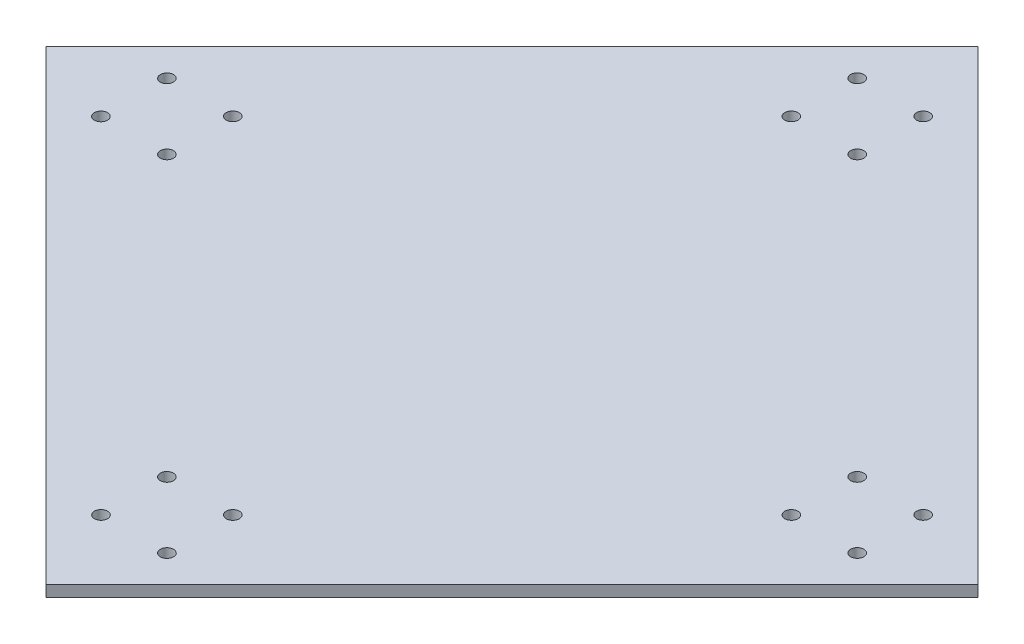
ISO-10303-21;
HEADER;
FILE_DESCRIPTION(('STEP AP214'),'2;1');
FILE_NAME('part.step','',(''),(''),'','','');
FILE_SCHEMA(('AUTOMOTIVE_DESIGN { 1 0 10303 214 1 1 1 1 }'));
ENDSEC;
DATA;
#1=APPLICATION_CONTEXT('core data for automotive mechanical design processes');
#2=APPLICATION_PROTOCOL_DEFINITION('international standard','automotive_design',2000,#1);
#3=PRODUCT_CONTEXT('',#1,'mechanical');
#4=PRODUCT('Part','Part','',(#3));
#5=PRODUCT_RELATED_PRODUCT_CATEGORY('part','',(#4));
#6=PRODUCT_DEFINITION_FORMATION('','',#4);
#7=PRODUCT_DEFINITION_CONTEXT('part definition',#1,'design');
#8=PRODUCT_DEFINITION('design','',#6,#7);
#9=PRODUCT_DEFINITION_SHAPE('','',#8);
#10=(LENGTH_UNIT() NAMED_UNIT(*) SI_UNIT(.MILLI.,.METRE.));
#11=(NAMED_UNIT(*) PLANE_ANGLE_UNIT() SI_UNIT($,.RADIAN.));
#12=(NAMED_UNIT(*) SI_UNIT($,.STERADIAN.) SOLID_ANGLE_UNIT());
#13=UNCERTAINTY_MEASURE_WITH_UNIT(LENGTH_MEASURE(1.E-05),#10,'distance_accuracy_value','');
#14=(GEOMETRIC_REPRESENTATION_CONTEXT(3) GLOBAL_UNCERTAINTY_ASSIGNED_CONTEXT((#13)) GLOBAL_UNIT_ASSIGNED_CONTEXT((#10,
#11,#12)) REPRESENTATION_CONTEXT('',''));
#15=CARTESIAN_POINT('',(0.,0.,0.));
#16=DIRECTION('',(0.,0.,1.));
#17=DIRECTION('',(1.,0.,0.));
#18=AXIS2_PLACEMENT_3D('',#15,#16,#17);
#19=CARTESIAN_POINT('',(141283.553059049,2500.,-141283.553059049));
#20=DIRECTION('',(0.707106781186548,0.,-0.707106781186548));
#21=DIRECTION('',(-0.707106781186548,0.,-0.707106781186548));
#22=AXIS2_PLACEMENT_3D('',#19,#20,#21);
#23=PLANE('',#22);
#24=DIRECTION('',(0.707106781186548,0.,0.707106781186548));
#25=VECTOR('',#24,1.);
#26=CARTESIAN_POINT('',(141283.553059049,0.,-141283.553059049));
#27=LINE('',#26,#25);
#28=CARTESIAN_POINT('',(94457.3926097364,0.,-188109.713508362));
#29=VERTEX_POINT('',#28);
#30=CARTESIAN_POINT('',(200523.409787719,0.,-82043.6963303794));
#31=VERTEX_POINT('',#30);
#32=EDGE_CURVE('E179',#29,#31,#27,.T.);
#33=ORIENTED_EDGE('',*,*,#32,.F.);
#34=DIRECTION('',(0.,-1.,0.));
#35=VECTOR('',#34,1.);
#36=CARTESIAN_POINT('',(94457.3926097364,2500.,-188109.713508362));
#37=LINE('',#36,#35);
#38=CARTESIAN_POINT('',(94457.3926097364,2500.,-188109.713508362));
#39=VERTEX_POINT('',#38);
#40=EDGE_CURVE('E11',#39,#29,#37,.T.);
#41=ORIENTED_EDGE('',*,*,#40,.F.);
#42=DIRECTION('',(0.707106781186548,0.,0.707106781186548));
#43=VECTOR('',#42,1.);
#44=CARTESIAN_POINT('',(141283.553059049,2500.,-141283.553059049));
#45=LINE('',#44,#43);
#46=CARTESIAN_POINT('',(200523.409787719,2500.,-82043.6963303794));
#47=VERTEX_POINT('',#46);
#48=EDGE_CURVE('E105',#39,#47,#45,.T.);
#49=ORIENTED_EDGE('',*,*,#48,.T.);
#50=DIRECTION('',(0.,-1.,0.));
#51=VECTOR('',#50,1.);
#52=CARTESIAN_POINT('',(200523.409787719,2500.,-82043.6963303794));
#53=LINE('',#52,#51);
#54=EDGE_CURVE('E82',#47,#31,#53,.T.);
#55=ORIENTED_EDGE('',*,*,#54,.T.);
#56=EDGE_LOOP('',(#33,#41,#49,#55));
#57=FACE_BOUND('',#56,.T.);
#58=ADVANCED_FACE('F41',(#57),#23,.T.);
#59=CARTESIAN_POINT('',(-46826.1595327832,2500.,-46826.1586240655));
#60=DIRECTION('',(-0.707106788047674,0.,-0.707106774325421));
#61=DIRECTION('',(-0.707106774325421,0.,0.707106788047674));
#62=AXIS2_PLACEMENT_3D('',#59,#60,#61);
#63=PLANE('',#62);
#64=DIRECTION('',(0.707106774325421,0.,-0.707106788047674));
#65=VECTOR('',#64,1.);
#66=CARTESIAN_POINT('',(-46826.1595327832,0.,-46826.1586240655));
#67=LINE('',#66,#65);
#68=CARTESIAN_POINT('',(-11608.6225099077,0.,-82043.6963303794));
#69=VERTEX_POINT('',#68);
#70=EDGE_CURVE('E94',#69,#29,#67,.T.);
#71=ORIENTED_EDGE('',*,*,#70,.F.);
#72=DIRECTION('',(0.,-1.,0.));
#73=VECTOR('',#72,1.);
#74=CARTESIAN_POINT('',(-11608.6225099077,2500.,-82043.6963303794));
#75=LINE('',#74,#73);
#76=CARTESIAN_POINT('',(-11608.6225099077,2500.,-82043.6963303794));
#77=VERTEX_POINT('',#76);
#78=EDGE_CURVE('E51',#77,#69,#75,.T.);
#79=ORIENTED_EDGE('',*,*,#78,.F.);
#80=DIRECTION('',(0.707106774325421,0.,-0.707106788047674));
#81=VECTOR('',#80,1.);
#82=CARTESIAN_POINT('',(-46826.1595327832,2500.,-46826.1586240655));
#83=LINE('',#82,#81);
#84=EDGE_CURVE('E92',#77,#39,#83,.T.);
#85=ORIENTED_EDGE('',*,*,#84,.T.);
#86=ORIENTED_EDGE('',*,*,#40,.T.);
#87=EDGE_LOOP('',(#71,#79,#85,#86));
#88=FACE_BOUND('',#87,.T.);
#89=ADVANCED_FACE('F90',(#88),#63,.T.);
#90=CARTESIAN_POINT('',(35217.5369102359,2500.,-35217.5369102359));
#91=DIRECTION('',(0.707106781186548,0.,-0.707106781186548));
#92=DIRECTION('',(-0.707106781186548,0.,-0.707106781186548));
#93=AXIS2_PLACEMENT_3D('',#90,#91,#92);
#94=PLANE('',#93);
#95=DIRECTION('',(0.707106781186548,0.,0.707106781186548));
#96=VECTOR('',#95,1.);
#97=CARTESIAN_POINT('',(35217.5369102359,0.,-35217.5369102359));
#98=LINE('',#97,#96);
#99=CARTESIAN_POINT('',(94472.1692847967,0.,24037.095464325));
#100=VERTEX_POINT('',#99);
#101=EDGE_CURVE('E184',#69,#100,#98,.T.);
#102=ORIENTED_EDGE('',*,*,#101,.T.);
#103=DIRECTION('',(0.,-1.,0.));
#104=VECTOR('',#103,1.);
#105=CARTESIAN_POINT('',(94472.1692847967,2500.,24037.095464325));
#106=LINE('',#105,#104);
#107=CARTESIAN_POINT('',(94472.1692847967,2500.,24037.095464325));
#108=VERTEX_POINT('',#107);
#109=EDGE_CURVE('E98',#108,#100,#106,.T.);
#110=ORIENTED_EDGE('',*,*,#109,.F.);
#111=DIRECTION('',(0.707106781186548,0.,0.707106781186548));
#112=VECTOR('',#111,1.);
#113=CARTESIAN_POINT('',(35217.5369102359,2500.,-35217.5369102359));
#114=LINE('',#113,#112);
#115=EDGE_CURVE('E100',#77,#108,#114,.T.);
#116=ORIENTED_EDGE('',*,*,#115,.F.);
#117=ORIENTED_EDGE('',*,*,#78,.T.);
#118=EDGE_LOOP('',(#102,#110,#116,#117));
#119=FACE_BOUND('',#118,.T.);
#120=ADVANCED_FACE('F101',(#119),#94,.F.);
#121=CARTESIAN_POINT('',(86957.3946680742,2500.,-168109.713508362));
#122=DIRECTION('',(0.,-1.,0.));
#123=DIRECTION('',(0.,0.,-1.));
#124=AXIS2_PLACEMENT_3D('',#121,#122,#123);
#125=CYLINDRICAL_SURFACE('',#124,1499.99999999997);
#126=CARTESIAN_POINT('',(86957.3946680742,2500.,-168109.713508362));
#127=DIRECTION('',(0.,1.,0.));
#128=DIRECTION('',(0.,0.,1.));
#129=AXIS2_PLACEMENT_3D('',#126,#127,#128);
#130=CIRCLE('',#129,1499.99999999997);
#131=CARTESIAN_POINT('',(86957.3946680742,2500.,-166609.713508362));
#132=VERTEX_POINT('',#131);
#133=EDGE_CURVE('E109',#132,#132,#130,.T.);
#134=ORIENTED_EDGE('',*,*,#133,.T.);
#135=EDGE_LOOP('',(#134));
#136=FACE_BOUND('',#135,.T.);
#137=CARTESIAN_POINT('',(86957.3946680742,0.,-168109.713508362));
#138=DIRECTION('',(0.,1.,0.));
#139=DIRECTION('',(0.,0.,1.));
#140=AXIS2_PLACEMENT_3D('',#137,#138,#139);
#141=CIRCLE('',#140,1499.99999999997);
#142=CARTESIAN_POINT('',(86957.3946680742,0.,-166609.713508362));
#143=VERTEX_POINT('',#142);
#144=EDGE_CURVE('E175',#143,#143,#141,.T.);
#145=ORIENTED_EDGE('',*,*,#144,.F.);
#146=EDGE_LOOP('',(#145));
#147=FACE_BOUND('',#146,.T.);
#148=ADVANCED_FACE('F204',(#136,#147),#125,.F.);
#149=CARTESIAN_POINT('',(101972.169284797,2500.,-168109.713508362));
#150=DIRECTION('',(0.,-1.,0.));
#151=DIRECTION('',(0.,0.,-1.));
#152=AXIS2_PLACEMENT_3D('',#149,#150,#151);
#153=CYLINDRICAL_SURFACE('',#152,1499.99999999997);
#154=CARTESIAN_POINT('',(101972.169284797,2500.,-168109.713508362));
#155=DIRECTION('',(0.,1.,0.));
#156=DIRECTION('',(0.,0.,1.));
#157=AXIS2_PLACEMENT_3D('',#154,#155,#156);
#158=CIRCLE('',#157,1499.99999999997);
#159=CARTESIAN_POINT('',(101972.169284797,2500.,-166609.713508362));
#160=VERTEX_POINT('',#159);
#161=EDGE_CURVE('E517',#160,#160,#158,.T.);
#162=ORIENTED_EDGE('',*,*,#161,.T.);
#163=EDGE_LOOP('',(#162));
#164=FACE_BOUND('',#163,.T.);
#165=CARTESIAN_POINT('',(101972.169284797,0.,-168109.713508362));
#166=DIRECTION('',(0.,1.,0.));
#167=DIRECTION('',(0.,0.,1.));
#168=AXIS2_PLACEMENT_3D('',#165,#166,#167);
#169=CIRCLE('',#168,1499.99999999997);
#170=CARTESIAN_POINT('',(101972.169284797,0.,-166609.713508362));
#171=VERTEX_POINT('',#170);
#172=EDGE_CURVE('E171',#171,#171,#169,.T.);
#173=ORIENTED_EDGE('',*,*,#172,.F.);
#174=EDGE_LOOP('',(#173));
#175=FACE_BOUND('',#174,.T.);
#176=ADVANCED_FACE('F207',(#164,#175),#153,.F.);
#177=CARTESIAN_POINT('',(101972.169284797,2500.,-153109.713508362));
#178=DIRECTION('',(0.,-1.,0.));
#179=DIRECTION('',(0.,0.,-1.));
#180=AXIS2_PLACEMENT_3D('',#177,#178,#179);
#181=CYLINDRICAL_SURFACE('',#180,1499.99999999997);
#182=CARTESIAN_POINT('',(101972.169284797,2500.,-153109.713508362));
#183=DIRECTION('',(0.,1.,0.));
#184=DIRECTION('',(0.,0.,1.));
#185=AXIS2_PLACEMENT_3D('',#182,#183,#184);
#186=CIRCLE('',#185,1499.99999999997);
#187=CARTESIAN_POINT('',(101972.169284797,2500.,-151609.713508362));
#188=VERTEX_POINT('',#187);
#189=EDGE_CURVE('E513',#188,#188,#186,.T.);
#190=ORIENTED_EDGE('',*,*,#189,.T.);
#191=EDGE_LOOP('',(#190));
#192=FACE_BOUND('',#191,.T.);
#193=CARTESIAN_POINT('',(101972.169284797,0.,-153109.713508362));
#194=DIRECTION('',(0.,1.,0.));
#195=DIRECTION('',(0.,0.,1.));
#196=AXIS2_PLACEMENT_3D('',#193,#194,#195);
#197=CIRCLE('',#196,1499.99999999997);
#198=CARTESIAN_POINT('',(101972.169284797,0.,-151609.713508362));
#199=VERTEX_POINT('',#198);
#200=EDGE_CURVE('E167',#199,#199,#197,.T.);
#201=ORIENTED_EDGE('',*,*,#200,.F.);
#202=EDGE_LOOP('',(#201));
#203=FACE_BOUND('',#202,.T.);
#204=ADVANCED_FACE('F211',(#192,#203),#181,.F.);
#205=CARTESIAN_POINT('',(86972.1692847967,2500.,-153109.713508362));
#206=DIRECTION('',(0.,-1.,0.));
#207=DIRECTION('',(0.,0.,-1.));
#208=AXIS2_PLACEMENT_3D('',#205,#206,#207);
#209=CYLINDRICAL_SURFACE('',#208,1499.99999999997);
#210=CARTESIAN_POINT('',(86972.1692847967,2500.,-153109.713508362));
#211=DIRECTION('',(0.,1.,0.));
#212=DIRECTION('',(0.,0.,1.));
#213=AXIS2_PLACEMENT_3D('',#210,#211,#212);
#214=CIRCLE('',#213,1499.99999999997);
#215=CARTESIAN_POINT('',(86972.1692847967,2500.,-151609.713508362));
#216=VERTEX_POINT('',#215);
#217=EDGE_CURVE('E509',#216,#216,#214,.T.);
#218=ORIENTED_EDGE('',*,*,#217,.T.);
#219=EDGE_LOOP('',(#218));
#220=FACE_BOUND('',#219,.T.);
#221=CARTESIAN_POINT('',(86972.1692847967,0.,-153109.713508362));
#222=DIRECTION('',(0.,1.,0.));
#223=DIRECTION('',(0.,0.,1.));
#224=AXIS2_PLACEMENT_3D('',#221,#222,#223);
#225=CIRCLE('',#224,1499.99999999997);
#226=CARTESIAN_POINT('',(86972.1692847967,0.,-151609.713508362));
#227=VERTEX_POINT('',#226);
#228=EDGE_CURVE('E163',#227,#227,#225,.T.);
#229=ORIENTED_EDGE('',*,*,#228,.F.);
#230=EDGE_LOOP('',(#229));
#231=FACE_BOUND('',#230,.T.);
#232=ADVANCED_FACE('F215',(#220,#231),#209,.F.);
#233=CARTESIAN_POINT('',(165538.186462783,2500.,-74543.6963303828));
#234=DIRECTION('',(0.,-1.,0.));
#235=DIRECTION('',(0.,0.,-1.));
#236=AXIS2_PLACEMENT_3D('',#233,#234,#235);
#237=CYLINDRICAL_SURFACE('',#236,1499.99999999997);
#238=CARTESIAN_POINT('',(165538.186462783,2500.,-74543.6963303828));
#239=DIRECTION('',(0.,1.,0.));
#240=DIRECTION('',(0.,0.,1.));
#241=AXIS2_PLACEMENT_3D('',#238,#239,#240);
#242=CIRCLE('',#241,1499.99999999997);
#243=CARTESIAN_POINT('',(165538.186462783,2500.,-73043.6963303828));
#244=VERTEX_POINT('',#243);
#245=EDGE_CURVE('E505',#244,#244,#242,.T.);
#246=ORIENTED_EDGE('',*,*,#245,.T.);
#247=EDGE_LOOP('',(#246));
#248=FACE_BOUND('',#247,.T.);
#249=CARTESIAN_POINT('',(165538.186462783,0.,-74543.6963303828));
#250=DIRECTION('',(0.,1.,0.));
#251=DIRECTION('',(0.,0.,1.));
#252=AXIS2_PLACEMENT_3D('',#249,#250,#251);
#253=CIRCLE('',#252,1499.99999999997);
#254=CARTESIAN_POINT('',(165538.186462783,0.,-73043.6963303828));
#255=VERTEX_POINT('',#254);
#256=EDGE_CURVE('E159',#255,#255,#253,.T.);
#257=ORIENTED_EDGE('',*,*,#256,.F.);
#258=EDGE_LOOP('',(#257));
#259=FACE_BOUND('',#258,.T.);
#260=ADVANCED_FACE('F219',(#248,#259),#237,.F.);
#261=CARTESIAN_POINT('',(86972.1692848042,2500.,-10977.6791523965));
#262=DIRECTION('',(0.,-1.,0.));
#263=DIRECTION('',(0.,0.,-1.));
#264=AXIS2_PLACEMENT_3D('',#261,#262,#263);
#265=CYLINDRICAL_SURFACE('',#264,1499.99999999997);
#266=CARTESIAN_POINT('',(86972.1692848042,2500.,-10977.6791523965));
#267=DIRECTION('',(0.,1.,0.));
#268=DIRECTION('',(0.,0.,1.));
#269=AXIS2_PLACEMENT_3D('',#266,#267,#268);
#270=CIRCLE('',#269,1499.99999999997);
#271=CARTESIAN_POINT('',(86972.1692848042,2500.,-9477.67915239655));
#272=VERTEX_POINT('',#271);
#273=EDGE_CURVE('E501',#272,#272,#270,.T.);
#274=ORIENTED_EDGE('',*,*,#273,.T.);
#275=EDGE_LOOP('',(#274));
#276=FACE_BOUND('',#275,.T.);
#277=CARTESIAN_POINT('',(86972.1692848042,0.,-10977.6791523965));
#278=DIRECTION('',(0.,1.,0.));
#279=DIRECTION('',(0.,0.,1.));
#280=AXIS2_PLACEMENT_3D('',#277,#278,#279);
#281=CIRCLE('',#280,1499.99999999997);
#282=CARTESIAN_POINT('',(86972.1692848042,0.,-9477.67915239655));
#283=VERTEX_POINT('',#282);
#284=EDGE_CURVE('E155',#283,#283,#281,.T.);
#285=ORIENTED_EDGE('',*,*,#284,.F.);
#286=EDGE_LOOP('',(#285));
#287=FACE_BOUND('',#286,.T.);
#288=ADVANCED_FACE('F223',(#276,#287),#265,.F.);
#289=CARTESIAN_POINT('',(23406.1521068183,2500.,-89543.6963303758));
#290=DIRECTION('',(0.,-1.,0.));
#291=DIRECTION('',(0.,0.,-1.));
#292=AXIS2_PLACEMENT_3D('',#289,#290,#291);
#293=CYLINDRICAL_SURFACE('',#292,1499.99999999997);
#294=CARTESIAN_POINT('',(23406.1521068183,2500.,-89543.6963303758));
#295=DIRECTION('',(0.,1.,0.));
#296=DIRECTION('',(0.,0.,1.));
#297=AXIS2_PLACEMENT_3D('',#294,#295,#296);
#298=CIRCLE('',#297,1499.99999999997);
#299=CARTESIAN_POINT('',(23406.1521068183,2500.,-88043.6963303758));
#300=VERTEX_POINT('',#299);
#301=EDGE_CURVE('E497',#300,#300,#298,.T.);
#302=ORIENTED_EDGE('',*,*,#301,.T.);
#303=EDGE_LOOP('',(#302));
#304=FACE_BOUND('',#303,.T.);
#305=CARTESIAN_POINT('',(23406.1521068183,0.,-89543.6963303758));
#306=DIRECTION('',(0.,1.,0.));
#307=DIRECTION('',(0.,0.,1.));
#308=AXIS2_PLACEMENT_3D('',#305,#306,#307);
#309=CIRCLE('',#308,1499.99999999997);
#310=CARTESIAN_POINT('',(23406.1521068183,0.,-88043.6963303758));
#311=VERTEX_POINT('',#310);
#312=EDGE_CURVE('E151',#311,#311,#309,.T.);
#313=ORIENTED_EDGE('',*,*,#312,.F.);
#314=EDGE_LOOP('',(#313));
#315=FACE_BOUND('',#314,.T.);
#316=ADVANCED_FACE('F227',(#304,#315),#293,.F.);
#317=CARTESIAN_POINT('',(180538.186462784,2500.,-89558.4709471061));
#318=DIRECTION('',(0.,-1.,0.));
#319=DIRECTION('',(0.,0.,-1.));
#320=AXIS2_PLACEMENT_3D('',#317,#318,#319);
#321=CYLINDRICAL_SURFACE('',#320,1499.99999999997);
#322=CARTESIAN_POINT('',(180538.186462784,2500.,-89558.4709471061));
#323=DIRECTION('',(0.,1.,0.));
#324=DIRECTION('',(0.,0.,1.));
#325=AXIS2_PLACEMENT_3D('',#322,#323,#324);
#326=CIRCLE('',#325,1499.99999999997);
#327=CARTESIAN_POINT('',(180538.186462784,2500.,-88058.4709471061));
#328=VERTEX_POINT('',#327);
#329=EDGE_CURVE('E493',#328,#328,#326,.T.);
#330=ORIENTED_EDGE('',*,*,#329,.T.);
#331=EDGE_LOOP('',(#330));
#332=FACE_BOUND('',#331,.T.);
#333=CARTESIAN_POINT('',(180538.186462784,0.,-89558.4709471061));
#334=DIRECTION('',(0.,1.,0.));
#335=DIRECTION('',(0.,0.,1.));
#336=AXIS2_PLACEMENT_3D('',#333,#334,#335);
#337=CIRCLE('',#336,1499.99999999997);
#338=CARTESIAN_POINT('',(180538.186462784,0.,-88058.4709471061));
#339=VERTEX_POINT('',#338);
#340=EDGE_CURVE('E147',#339,#339,#337,.T.);
#341=ORIENTED_EDGE('',*,*,#340,.F.);
#342=EDGE_LOOP('',(#341));
#343=FACE_BOUND('',#342,.T.);
#344=ADVANCED_FACE('F231',(#332,#343),#321,.F.);
#345=CARTESIAN_POINT('',(180538.186462784,2500.,-74543.6963303836));
#346=DIRECTION('',(0.,-1.,0.));
#347=DIRECTION('',(0.,0.,-1.));
#348=AXIS2_PLACEMENT_3D('',#345,#346,#347);
#349=CYLINDRICAL_SURFACE('',#348,1499.99999999997);
#350=CARTESIAN_POINT('',(180538.186462784,2500.,-74543.6963303836));
#351=DIRECTION('',(0.,1.,0.));
#352=DIRECTION('',(0.,0.,1.));
#353=AXIS2_PLACEMENT_3D('',#350,#351,#352);
#354=CIRCLE('',#353,1499.99999999997);
#355=CARTESIAN_POINT('',(180538.186462784,2500.,-73043.6963303836));
#356=VERTEX_POINT('',#355);
#357=EDGE_CURVE('E489',#356,#356,#354,.T.);
#358=ORIENTED_EDGE('',*,*,#357,.T.);
#359=EDGE_LOOP('',(#358));
#360=FACE_BOUND('',#359,.T.);
#361=CARTESIAN_POINT('',(180538.186462784,0.,-74543.6963303836));
#362=DIRECTION('',(0.,1.,0.));
#363=DIRECTION('',(0.,0.,1.));
#364=AXIS2_PLACEMENT_3D('',#361,#362,#363);
#365=CIRCLE('',#364,1499.99999999997);
#366=CARTESIAN_POINT('',(180538.186462784,0.,-73043.6963303836));
#367=VERTEX_POINT('',#366);
#368=EDGE_CURVE('E143',#367,#367,#365,.T.);
#369=ORIENTED_EDGE('',*,*,#368,.F.);
#370=EDGE_LOOP('',(#369));
#371=FACE_BOUND('',#370,.T.);
#372=ADVANCED_FACE('F235',(#360,#371),#349,.F.);
#373=CARTESIAN_POINT('',(165538.186462784,2500.,-89543.6963303837));
#374=DIRECTION('',(0.,-1.,0.));
#375=DIRECTION('',(0.,0.,-1.));
#376=AXIS2_PLACEMENT_3D('',#373,#374,#375);
#377=CYLINDRICAL_SURFACE('',#376,1499.99999999997);
#378=CARTESIAN_POINT('',(165538.186462784,2500.,-89543.6963303837));
#379=DIRECTION('',(0.,1.,0.));
#380=DIRECTION('',(0.,0.,1.));
#381=AXIS2_PLACEMENT_3D('',#378,#379,#380);
#382=CIRCLE('',#381,1499.99999999997);
#383=CARTESIAN_POINT('',(165538.186462784,2500.,-88043.6963303837));
#384=VERTEX_POINT('',#383);
#385=EDGE_CURVE('E485',#384,#384,#382,.T.);
#386=ORIENTED_EDGE('',*,*,#385,.T.);
#387=EDGE_LOOP('',(#386));
#388=FACE_BOUND('',#387,.T.);
#389=CARTESIAN_POINT('',(165538.186462784,0.,-89543.6963303837));
#390=DIRECTION('',(0.,1.,0.));
#391=DIRECTION('',(0.,0.,1.));
#392=AXIS2_PLACEMENT_3D('',#389,#390,#391);
#393=CIRCLE('',#392,1499.99999999997);
#394=CARTESIAN_POINT('',(165538.186462784,0.,-88043.6963303837));
#395=VERTEX_POINT('',#394);
#396=EDGE_CURVE('E139',#395,#395,#393,.T.);
#397=ORIENTED_EDGE('',*,*,#396,.F.);
#398=EDGE_LOOP('',(#397));
#399=FACE_BOUND('',#398,.T.);
#400=ADVANCED_FACE('F239',(#388,#399),#377,.F.);
#401=CARTESIAN_POINT('',(101986.943901529,2500.,4022.32084760379));
#402=DIRECTION('',(0.,-1.,0.));
#403=DIRECTION('',(0.,0.,-1.));
#404=AXIS2_PLACEMENT_3D('',#401,#402,#403);
#405=CYLINDRICAL_SURFACE('',#404,1499.99999999996);
#406=CARTESIAN_POINT('',(101986.943901529,2500.,4022.32084760379));
#407=DIRECTION('',(0.,1.,0.));
#408=DIRECTION('',(0.,0.,1.));
#409=AXIS2_PLACEMENT_3D('',#406,#407,#408);
#410=CIRCLE('',#409,1499.99999999996);
#411=CARTESIAN_POINT('',(101986.943901529,2500.,5522.32084760375));
#412=VERTEX_POINT('',#411);
#413=EDGE_CURVE('E481',#412,#412,#410,.T.);
#414=ORIENTED_EDGE('',*,*,#413,.T.);
#415=EDGE_LOOP('',(#414));
#416=FACE_BOUND('',#415,.T.);
#417=CARTESIAN_POINT('',(101986.943901529,0.,4022.32084760379));
#418=DIRECTION('',(0.,1.,0.));
#419=DIRECTION('',(0.,0.,1.));
#420=AXIS2_PLACEMENT_3D('',#417,#418,#419);
#421=CIRCLE('',#420,1499.99999999996);
#422=CARTESIAN_POINT('',(101986.943901529,0.,5522.32084760375));
#423=VERTEX_POINT('',#422);
#424=EDGE_CURVE('E135',#423,#423,#421,.T.);
#425=ORIENTED_EDGE('',*,*,#424,.F.);
#426=EDGE_LOOP('',(#425));
#427=FACE_BOUND('',#426,.T.);
#428=ADVANCED_FACE('F243',(#416,#427),#405,.F.);
#429=CARTESIAN_POINT('',(86972.1692848061,2500.,4022.32084760371));
#430=DIRECTION('',(0.,-1.,0.));
#431=DIRECTION('',(0.,0.,-1.));
#432=AXIS2_PLACEMENT_3D('',#429,#430,#431);
#433=CYLINDRICAL_SURFACE('',#432,1499.99999999997);
#434=CARTESIAN_POINT('',(86972.1692848061,2500.,4022.32084760371));
#435=DIRECTION('',(0.,1.,0.));
#436=DIRECTION('',(0.,0.,1.));
#437=AXIS2_PLACEMENT_3D('',#434,#435,#436);
#438=CIRCLE('',#437,1499.99999999997);
#439=CARTESIAN_POINT('',(86972.1692848061,2500.,5522.32084760367));
#440=VERTEX_POINT('',#439);
#441=EDGE_CURVE('E477',#440,#440,#438,.T.);
#442=ORIENTED_EDGE('',*,*,#441,.T.);
#443=EDGE_LOOP('',(#442));
#444=FACE_BOUND('',#443,.T.);
#445=CARTESIAN_POINT('',(86972.1692848061,0.,4022.32084760371));
#446=DIRECTION('',(0.,1.,0.));
#447=DIRECTION('',(0.,0.,1.));
#448=AXIS2_PLACEMENT_3D('',#445,#446,#447);
#449=CIRCLE('',#448,1499.99999999997);
#450=CARTESIAN_POINT('',(86972.1692848061,0.,5522.32084760367));
#451=VERTEX_POINT('',#450);
#452=EDGE_CURVE('E131',#451,#451,#449,.T.);
#453=ORIENTED_EDGE('',*,*,#452,.F.);
#454=EDGE_LOOP('',(#453));
#455=FACE_BOUND('',#454,.T.);
#456=ADVANCED_FACE('F247',(#444,#455),#433,.F.);
#457=CARTESIAN_POINT('',(101972.169284806,2500.,-10977.6791523962));
#458=DIRECTION('',(0.,-1.,0.));
#459=DIRECTION('',(0.,0.,-1.));
#460=AXIS2_PLACEMENT_3D('',#457,#458,#459);
#461=CYLINDRICAL_SURFACE('',#460,1499.99999999996);
#462=CARTESIAN_POINT('',(101972.169284806,2500.,-10977.6791523962));
#463=DIRECTION('',(0.,1.,0.));
#464=DIRECTION('',(0.,0.,1.));
#465=AXIS2_PLACEMENT_3D('',#462,#463,#464);
#466=CIRCLE('',#465,1499.99999999996);
#467=CARTESIAN_POINT('',(101972.169284806,2500.,-9477.67915239622));
#468=VERTEX_POINT('',#467);
#469=EDGE_CURVE('E473',#468,#468,#466,.T.);
#470=ORIENTED_EDGE('',*,*,#469,.T.);
#471=EDGE_LOOP('',(#470));
#472=FACE_BOUND('',#471,.T.);
#473=CARTESIAN_POINT('',(101972.169284806,0.,-10977.6791523962));
#474=DIRECTION('',(0.,1.,0.));
#475=DIRECTION('',(0.,0.,1.));
#476=AXIS2_PLACEMENT_3D('',#473,#474,#475);
#477=CIRCLE('',#476,1499.99999999996);
#478=CARTESIAN_POINT('',(101972.169284806,0.,-9477.67915239622));
#479=VERTEX_POINT('',#478);
#480=EDGE_CURVE('E127',#479,#479,#477,.T.);
#481=ORIENTED_EDGE('',*,*,#480,.F.);
#482=EDGE_LOOP('',(#481));
#483=FACE_BOUND('',#482,.T.);
#484=ADVANCED_FACE('F251',(#472,#483),#461,.F.);
#485=CARTESIAN_POINT('',(8406.15210681904,2500.,-74528.9217136523));
#486=DIRECTION('',(0.,-1.,0.));
#487=DIRECTION('',(0.,0.,-1.));
#488=AXIS2_PLACEMENT_3D('',#485,#486,#487);
#489=CYLINDRICAL_SURFACE('',#488,1499.99999999996);
#490=CARTESIAN_POINT('',(8406.15210681904,2500.,-74528.9217136523));
#491=DIRECTION('',(0.,1.,0.));
#492=DIRECTION('',(0.,0.,1.));
#493=AXIS2_PLACEMENT_3D('',#490,#491,#492);
#494=CIRCLE('',#493,1499.99999999996);
#495=CARTESIAN_POINT('',(8406.15210681904,2500.,-73028.9217136524));
#496=VERTEX_POINT('',#495);
#497=EDGE_CURVE('E469',#496,#496,#494,.T.);
#498=ORIENTED_EDGE('',*,*,#497,.T.);
#499=EDGE_LOOP('',(#498));
#500=FACE_BOUND('',#499,.T.);
#501=CARTESIAN_POINT('',(8406.15210681904,0.,-74528.9217136523));
#502=DIRECTION('',(0.,1.,0.));
#503=DIRECTION('',(0.,0.,1.));
#504=AXIS2_PLACEMENT_3D('',#501,#502,#503);
#505=CIRCLE('',#504,1499.99999999996);
#506=CARTESIAN_POINT('',(8406.15210681904,0.,-73028.9217136524));
#507=VERTEX_POINT('',#506);
#508=EDGE_CURVE('E123',#507,#507,#505,.T.);
#509=ORIENTED_EDGE('',*,*,#508,.F.);
#510=EDGE_LOOP('',(#509));
#511=FACE_BOUND('',#510,.T.);
#512=ADVANCED_FACE('F255',(#500,#511),#489,.F.);
#513=CARTESIAN_POINT('',(8406.15210681918,2500.,-89543.6963303748));
#514=DIRECTION('',(0.,-1.,0.));
#515=DIRECTION('',(0.,0.,-1.));
#516=AXIS2_PLACEMENT_3D('',#513,#514,#515);
#517=CYLINDRICAL_SURFACE('',#516,1499.99999999997);
#518=CARTESIAN_POINT('',(8406.15210681918,2500.,-89543.6963303748));
#519=DIRECTION('',(0.,1.,0.));
#520=DIRECTION('',(0.,0.,1.));
#521=AXIS2_PLACEMENT_3D('',#518,#519,#520);
#522=CIRCLE('',#521,1499.99999999997);
#523=CARTESIAN_POINT('',(8406.15210681918,2500.,-88043.6963303748));
#524=VERTEX_POINT('',#523);
#525=EDGE_CURVE('E269',#524,#524,#522,.T.);
#526=ORIENTED_EDGE('',*,*,#525,.T.);
#527=EDGE_LOOP('',(#526));
#528=FACE_BOUND('',#527,.T.);
#529=CARTESIAN_POINT('',(8406.15210681918,0.,-89543.6963303748));
#530=DIRECTION('',(0.,1.,0.));
#531=DIRECTION('',(0.,0.,1.));
#532=AXIS2_PLACEMENT_3D('',#529,#530,#531);
#533=CIRCLE('',#532,1499.99999999997);
#534=CARTESIAN_POINT('',(8406.15210681918,0.,-88043.6963303748));
#535=VERTEX_POINT('',#534);
#536=EDGE_CURVE('E119',#535,#535,#533,.T.);
#537=ORIENTED_EDGE('',*,*,#536,.F.);
#538=EDGE_LOOP('',(#537));
#539=FACE_BOUND('',#538,.T.);
#540=ADVANCED_FACE('F258',(#528,#539),#517,.F.);
#541=CARTESIAN_POINT('',(23406.152106819,2500.,-74543.6963303747));
#542=DIRECTION('',(0.,-1.,0.));
#543=DIRECTION('',(0.,0.,-1.));
#544=AXIS2_PLACEMENT_3D('',#541,#542,#543);
#545=CYLINDRICAL_SURFACE('',#544,1499.99999999996);
#546=CARTESIAN_POINT('',(23406.152106819,2500.,-74543.6963303747));
#547=DIRECTION('',(0.,1.,0.));
#548=DIRECTION('',(0.,0.,1.));
#549=AXIS2_PLACEMENT_3D('',#546,#547,#548);
#550=CIRCLE('',#549,1499.99999999996);
#551=CARTESIAN_POINT('',(23406.152106819,2500.,-73043.6963303747));
#552=VERTEX_POINT('',#551);
#553=EDGE_CURVE('E189',#552,#552,#550,.T.);
#554=ORIENTED_EDGE('',*,*,#553,.T.);
#555=EDGE_LOOP('',(#554));
#556=FACE_BOUND('',#555,.T.);
#557=CARTESIAN_POINT('',(23406.152106819,0.,-74543.6963303747));
#558=DIRECTION('',(0.,1.,0.));
#559=DIRECTION('',(0.,0.,1.));
#560=AXIS2_PLACEMENT_3D('',#557,#558,#559);
#561=CIRCLE('',#560,1499.99999999996);
#562=CARTESIAN_POINT('',(23406.152106819,0.,-73043.6963303747));
#563=VERTEX_POINT('',#562);
#564=EDGE_CURVE('E115',#563,#563,#561,.T.);
#565=ORIENTED_EDGE('',*,*,#564,.F.);
#566=EDGE_LOOP('',(#565));
#567=FACE_BOUND('',#566,.T.);
#568=ADVANCED_FACE('F43',(#556,#567),#545,.F.);
#569=CARTESIAN_POINT('',(59267.7924598272,2500.,59251.2820266125));
#570=DIRECTION('',(-0.707205278631363,0.,-0.707008270019479));
#571=DIRECTION('',(-0.707008270019479,0.,0.707205278631363));
#572=AXIS2_PLACEMENT_3D('',#569,#570,#571);
#573=PLANE('',#572);
#574=DIRECTION('',(0.707008270019479,0.,-0.707205278631363));
#575=VECTOR('',#574,1.);
#576=CARTESIAN_POINT('',(59267.7924598272,0.,59251.2820266125));
#577=LINE('',#576,#575);
#578=EDGE_CURVE('E75',#100,#31,#577,.T.);
#579=ORIENTED_EDGE('',*,*,#578,.T.);
#580=ORIENTED_EDGE('',*,*,#54,.F.);
#581=DIRECTION('',(0.707008270019479,0.,-0.707205278631363));
#582=VECTOR('',#581,1.);
#583=CARTESIAN_POINT('',(59267.7924598272,2500.,59251.2820266125));
#584=LINE('',#583,#582);
#585=EDGE_CURVE('E59',#108,#47,#584,.T.);
#586=ORIENTED_EDGE('',*,*,#585,.F.);
#587=ORIENTED_EDGE('',*,*,#109,.T.);
#588=EDGE_LOOP('',(#579,#580,#586,#587));
#589=FACE_BOUND('',#588,.T.);
#590=ADVANCED_FACE('F194',(#589),#573,.F.);
#591=CARTESIAN_POINT('',(0.,2500.,0.));
#592=DIRECTION('',(0.,1.,0.));
#593=DIRECTION('',(0.,0.,1.));
#594=AXIS2_PLACEMENT_3D('',#591,#592,#593);
#595=PLANE('',#594);
#596=ORIENTED_EDGE('',*,*,#553,.F.);
#597=EDGE_LOOP('',(#596));
#598=FACE_BOUND('',#597,.T.);
#599=ORIENTED_EDGE('',*,*,#525,.F.);
#600=EDGE_LOOP('',(#599));
#601=FACE_BOUND('',#600,.T.);
#602=ORIENTED_EDGE('',*,*,#497,.F.);
#603=EDGE_LOOP('',(#602));
#604=FACE_BOUND('',#603,.T.);
#605=ORIENTED_EDGE('',*,*,#469,.F.);
#606=EDGE_LOOP('',(#605));
#607=FACE_BOUND('',#606,.T.);
#608=ORIENTED_EDGE('',*,*,#441,.F.);
#609=EDGE_LOOP('',(#608));
#610=FACE_BOUND('',#609,.T.);
#611=ORIENTED_EDGE('',*,*,#413,.F.);
#612=EDGE_LOOP('',(#611));
#613=FACE_BOUND('',#612,.T.);
#614=ORIENTED_EDGE('',*,*,#385,.F.);
#615=EDGE_LOOP('',(#614));
#616=FACE_BOUND('',#615,.T.);
#617=ORIENTED_EDGE('',*,*,#357,.F.);
#618=EDGE_LOOP('',(#617));
#619=FACE_BOUND('',#618,.T.);
#620=ORIENTED_EDGE('',*,*,#329,.F.);
#621=EDGE_LOOP('',(#620));
#622=FACE_BOUND('',#621,.T.);
#623=ORIENTED_EDGE('',*,*,#301,.F.);
#624=EDGE_LOOP('',(#623));
#625=FACE_BOUND('',#624,.T.);
#626=ORIENTED_EDGE('',*,*,#273,.F.);
#627=EDGE_LOOP('',(#626));
#628=FACE_BOUND('',#627,.T.);
#629=ORIENTED_EDGE('',*,*,#245,.F.);
#630=EDGE_LOOP('',(#629));
#631=FACE_BOUND('',#630,.T.);
#632=ORIENTED_EDGE('',*,*,#217,.F.);
#633=EDGE_LOOP('',(#632));
#634=FACE_BOUND('',#633,.T.);
#635=ORIENTED_EDGE('',*,*,#189,.F.);
#636=EDGE_LOOP('',(#635));
#637=FACE_BOUND('',#636,.T.);
#638=ORIENTED_EDGE('',*,*,#161,.F.);
#639=EDGE_LOOP('',(#638));
#640=FACE_BOUND('',#639,.T.);
#641=ORIENTED_EDGE('',*,*,#133,.F.);
#642=EDGE_LOOP('',(#641));
#643=FACE_BOUND('',#642,.T.);
#644=ORIENTED_EDGE('',*,*,#48,.F.);
#645=ORIENTED_EDGE('',*,*,#84,.F.);
#646=ORIENTED_EDGE('',*,*,#115,.T.);
#647=ORIENTED_EDGE('',*,*,#585,.T.);
#648=EDGE_LOOP('',(#644,#645,#646,#647));
#649=FACE_BOUND('',#648,.T.);
#650=ADVANCED_FACE('F104',(#598,#601,#604,#607,#610,#613,#616,#619,#622,#625,#628,#631,#634,
#637,#640,#643,#649),#595,.T.);
#651=CARTESIAN_POINT('',(0.,0.,0.));
#652=DIRECTION('',(0.,1.,0.));
#653=DIRECTION('',(0.,0.,1.));
#654=AXIS2_PLACEMENT_3D('',#651,#652,#653);
#655=PLANE('',#654);
#656=ORIENTED_EDGE('',*,*,#564,.T.);
#657=EDGE_LOOP('',(#656));
#658=FACE_BOUND('',#657,.T.);
#659=ORIENTED_EDGE('',*,*,#536,.T.);
#660=EDGE_LOOP('',(#659));
#661=FACE_BOUND('',#660,.T.);
#662=ORIENTED_EDGE('',*,*,#508,.T.);
#663=EDGE_LOOP('',(#662));
#664=FACE_BOUND('',#663,.T.);
#665=ORIENTED_EDGE('',*,*,#480,.T.);
#666=EDGE_LOOP('',(#665));
#667=FACE_BOUND('',#666,.T.);
#668=ORIENTED_EDGE('',*,*,#452,.T.);
#669=EDGE_LOOP('',(#668));
#670=FACE_BOUND('',#669,.T.);
#671=ORIENTED_EDGE('',*,*,#424,.T.);
#672=EDGE_LOOP('',(#671));
#673=FACE_BOUND('',#672,.T.);
#674=ORIENTED_EDGE('',*,*,#396,.T.);
#675=EDGE_LOOP('',(#674));
#676=FACE_BOUND('',#675,.T.);
#677=ORIENTED_EDGE('',*,*,#368,.T.);
#678=EDGE_LOOP('',(#677));
#679=FACE_BOUND('',#678,.T.);
#680=ORIENTED_EDGE('',*,*,#340,.T.);
#681=EDGE_LOOP('',(#680));
#682=FACE_BOUND('',#681,.T.);
#683=ORIENTED_EDGE('',*,*,#312,.T.);
#684=EDGE_LOOP('',(#683));
#685=FACE_BOUND('',#684,.T.);
#686=ORIENTED_EDGE('',*,*,#284,.T.);
#687=EDGE_LOOP('',(#686));
#688=FACE_BOUND('',#687,.T.);
#689=ORIENTED_EDGE('',*,*,#256,.T.);
#690=EDGE_LOOP('',(#689));
#691=FACE_BOUND('',#690,.T.);
#692=ORIENTED_EDGE('',*,*,#228,.T.);
#693=EDGE_LOOP('',(#692));
#694=FACE_BOUND('',#693,.T.);
#695=ORIENTED_EDGE('',*,*,#200,.T.);
#696=EDGE_LOOP('',(#695));
#697=FACE_BOUND('',#696,.T.);
#698=ORIENTED_EDGE('',*,*,#172,.T.);
#699=EDGE_LOOP('',(#698));
#700=FACE_BOUND('',#699,.T.);
#701=ORIENTED_EDGE('',*,*,#144,.T.);
#702=EDGE_LOOP('',(#701));
#703=FACE_BOUND('',#702,.T.);
#704=ORIENTED_EDGE('',*,*,#32,.T.);
#705=ORIENTED_EDGE('',*,*,#578,.F.);
#706=ORIENTED_EDGE('',*,*,#101,.F.);
#707=ORIENTED_EDGE('',*,*,#70,.T.);
#708=EDGE_LOOP('',(#704,#705,#706,#707));
#709=FACE_BOUND('',#708,.T.);
#710=ADVANCED_FACE('F195',(#658,#661,#664,#667,#670,#673,#676,#679,#682,#685,#688,#691,#694,
#697,#700,#703,#709),#655,.F.);
#711=CLOSED_SHELL('',(#58,#89,#120,#148,#176,#204,#232,#260,#288,#316,#344,#372,#400,#428,#456,
#484,#512,#540,#568,#590,#650,#710));
#712=MANIFOLD_SOLID_BREP('B2',#711);
#713=ADVANCED_BREP_SHAPE_REPRESENTATION('',(#18,#712),#14);
#714=SHAPE_DEFINITION_REPRESENTATION(#9,#713);
ENDSEC;
END-ISO-10303-21;
